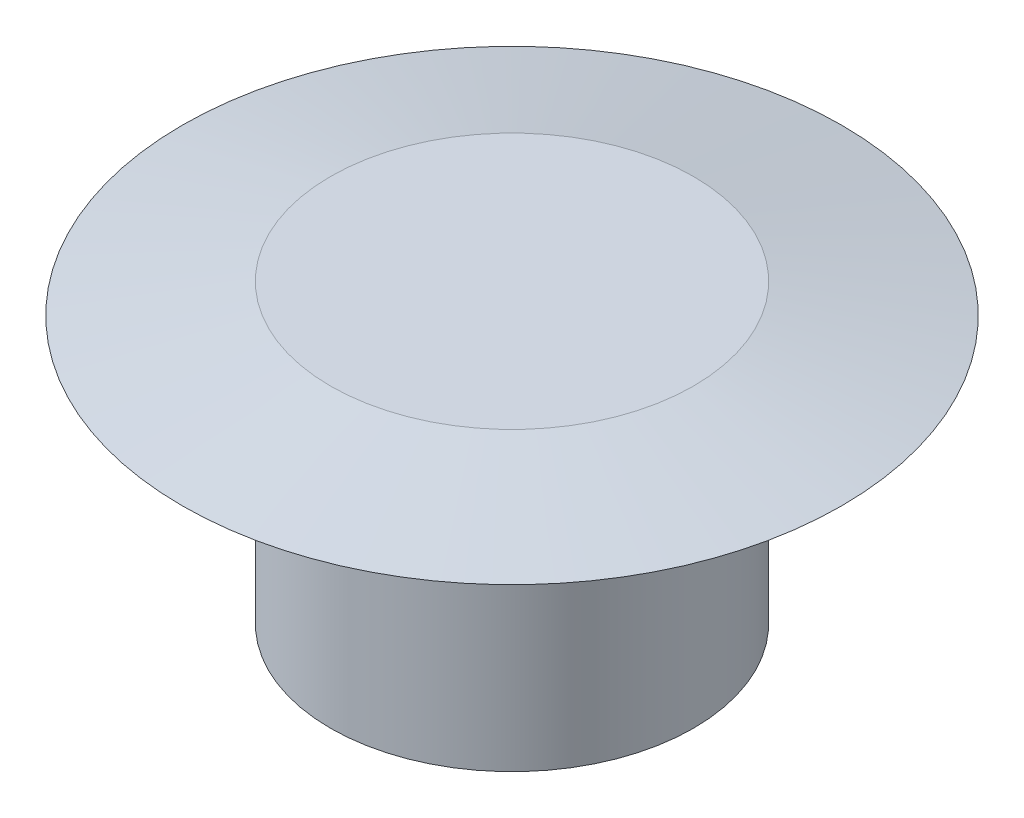
ISO-10303-21;
HEADER;
FILE_DESCRIPTION(('STEP AP214'),'2;1');
FILE_NAME('part.step','',(''),(''),'','','');
FILE_SCHEMA(('AUTOMOTIVE_DESIGN { 1 0 10303 214 1 1 1 1 }'));
ENDSEC;
DATA;
#1=APPLICATION_CONTEXT('core data for automotive mechanical design processes');
#2=APPLICATION_PROTOCOL_DEFINITION('international standard','automotive_design',2000,#1);
#3=PRODUCT_CONTEXT('',#1,'mechanical');
#4=PRODUCT('Part','Part','',(#3));
#5=PRODUCT_RELATED_PRODUCT_CATEGORY('part','',(#4));
#6=PRODUCT_DEFINITION_FORMATION('','',#4);
#7=PRODUCT_DEFINITION_CONTEXT('part definition',#1,'design');
#8=PRODUCT_DEFINITION('design','',#6,#7);
#9=PRODUCT_DEFINITION_SHAPE('','',#8);
#10=(LENGTH_UNIT() NAMED_UNIT(*) SI_UNIT(.MILLI.,.METRE.));
#11=(NAMED_UNIT(*) PLANE_ANGLE_UNIT() SI_UNIT($,.RADIAN.));
#12=(NAMED_UNIT(*) SI_UNIT($,.STERADIAN.) SOLID_ANGLE_UNIT());
#13=UNCERTAINTY_MEASURE_WITH_UNIT(LENGTH_MEASURE(1.E-05),#10,'distance_accuracy_value','');
#14=(GEOMETRIC_REPRESENTATION_CONTEXT(3) GLOBAL_UNCERTAINTY_ASSIGNED_CONTEXT((#13)) GLOBAL_UNIT_ASSIGNED_CONTEXT((#10,
#11,#12)) REPRESENTATION_CONTEXT('',''));
#15=CARTESIAN_POINT('',(0.,0.,0.));
#16=DIRECTION('',(0.,0.,1.));
#17=DIRECTION('',(1.,0.,0.));
#18=AXIS2_PLACEMENT_3D('',#15,#16,#17);
#19=CARTESIAN_POINT('',(0.,0.,0.));
#20=DIRECTION('',(0.,-1.,0.));
#21=DIRECTION('',(0.,0.,-1.));
#22=AXIS2_PLACEMENT_3D('',#19,#20,#21);
#23=CYLINDRICAL_SURFACE('',#22,10.9);
#24=CARTESIAN_POINT('',(0.,0.,0.));
#25=DIRECTION('',(0.,-1.,0.));
#26=DIRECTION('',(0.,0.,-1.));
#27=AXIS2_PLACEMENT_3D('',#24,#25,#26);
#28=CIRCLE('',#27,10.9);
#29=CARTESIAN_POINT('',(0.,0.,-10.9));
#30=VERTEX_POINT('',#29);
#31=EDGE_CURVE('E38',#30,#30,#28,.T.);
#32=ORIENTED_EDGE('',*,*,#31,.T.);
#33=EDGE_LOOP('',(#32));
#34=FACE_BOUND('',#33,.T.);
#35=CARTESIAN_POINT('',(0.,18.65,0.));
#36=DIRECTION('',(0.,1.,0.));
#37=DIRECTION('',(0.,0.,1.));
#38=AXIS2_PLACEMENT_3D('',#35,#36,#37);
#39=CIRCLE('',#38,10.9);
#40=CARTESIAN_POINT('',(0.,18.65,10.9));
#41=VERTEX_POINT('',#40);
#42=EDGE_CURVE('E10',#41,#41,#39,.F.);
#43=ORIENTED_EDGE('',*,*,#42,.F.);
#44=EDGE_LOOP('',(#43));
#45=FACE_BOUND('',#44,.T.);
#46=ADVANCED_FACE('F31',(#34,#45),#23,.F.);
#47=CARTESIAN_POINT('',(-12.25,20.,0.));
#48=DIRECTION('',(0.,-1.,0.));
#49=DIRECTION('',(0.,0.,-1.));
#50=AXIS2_PLACEMENT_3D('',#47,#48,#49);
#51=PLANE('',#50);
#52=CARTESIAN_POINT('',(0.,20.,0.));
#53=DIRECTION('',(0.,-1.,0.));
#54=DIRECTION('',(0.,0.,-1.));
#55=AXIS2_PLACEMENT_3D('',#52,#53,#54);
#56=CIRCLE('',#55,12.25);
#57=CARTESIAN_POINT('',(0.,20.,-12.25));
#58=VERTEX_POINT('',#57);
#59=EDGE_CURVE('E54',#58,#58,#56,.T.);
#60=ORIENTED_EDGE('',*,*,#59,.F.);
#61=EDGE_LOOP('',(#60));
#62=FACE_BOUND('',#61,.T.);
#63=ADVANCED_FACE('F33',(#62),#51,.F.);
#64=CARTESIAN_POINT('',(-10.9,0.,0.));
#65=DIRECTION('',(0.,1.,0.));
#66=DIRECTION('',(0.,0.,1.));
#67=AXIS2_PLACEMENT_3D('',#64,#65,#66);
#68=PLANE('',#67);
#69=ORIENTED_EDGE('',*,*,#31,.F.);
#70=EDGE_LOOP('',(#69));
#71=FACE_BOUND('',#70,.T.);
#72=CARTESIAN_POINT('',(0.,0.,0.));
#73=DIRECTION('',(0.,-1.,0.));
#74=DIRECTION('',(0.,0.,-1.));
#75=AXIS2_PLACEMENT_3D('',#72,#73,#74);
#76=CIRCLE('',#75,12.25);
#77=CARTESIAN_POINT('',(0.,0.,-12.25));
#78=VERTEX_POINT('',#77);
#79=EDGE_CURVE('E42',#78,#78,#76,.T.);
#80=ORIENTED_EDGE('',*,*,#79,.T.);
#81=EDGE_LOOP('',(#80));
#82=FACE_BOUND('',#81,.T.);
#83=ADVANCED_FACE('F61',(#71,#82),#68,.F.);
#84=CARTESIAN_POINT('',(0.,0.,0.));
#85=DIRECTION('',(0.,-1.,0.));
#86=DIRECTION('',(0.,0.,-1.));
#87=AXIS2_PLACEMENT_3D('',#84,#85,#86);
#88=CYLINDRICAL_SURFACE('',#87,12.25);
#89=ORIENTED_EDGE('',*,*,#79,.F.);
#90=EDGE_LOOP('',(#89));
#91=FACE_BOUND('',#90,.T.);
#92=CARTESIAN_POINT('',(0.,18.,0.));
#93=DIRECTION('',(0.,-1.,0.));
#94=DIRECTION('',(0.,0.,-1.));
#95=AXIS2_PLACEMENT_3D('',#92,#93,#94);
#96=CIRCLE('',#95,12.25);
#97=CARTESIAN_POINT('',(0.,18.,-12.25));
#98=VERTEX_POINT('',#97);
#99=EDGE_CURVE('E46',#98,#98,#96,.T.);
#100=ORIENTED_EDGE('',*,*,#99,.T.);
#101=EDGE_LOOP('',(#100));
#102=FACE_BOUND('',#101,.T.);
#103=ADVANCED_FACE('F66',(#91,#102),#88,.T.);
#104=CARTESIAN_POINT('',(-12.25,18.,0.));
#105=DIRECTION('',(0.,1.,0.));
#106=DIRECTION('',(0.,0.,1.));
#107=AXIS2_PLACEMENT_3D('',#104,#105,#106);
#108=PLANE('',#107);
#109=ORIENTED_EDGE('',*,*,#99,.F.);
#110=EDGE_LOOP('',(#109));
#111=FACE_BOUND('',#110,.T.);
#112=CARTESIAN_POINT('',(0.,18.,0.));
#113=DIRECTION('',(0.,-1.,0.));
#114=DIRECTION('',(0.,0.,-1.));
#115=AXIS2_PLACEMENT_3D('',#112,#113,#114);
#116=CIRCLE('',#115,22.25);
#117=CARTESIAN_POINT('',(0.,18.,-22.25));
#118=VERTEX_POINT('',#117);
#119=EDGE_CURVE('E51',#118,#118,#116,.T.);
#120=ORIENTED_EDGE('',*,*,#119,.T.);
#121=EDGE_LOOP('',(#120));
#122=FACE_BOUND('',#121,.T.);
#123=ADVANCED_FACE('F75',(#111,#122),#108,.F.);
#124=CARTESIAN_POINT('',(0.,20.,0.));
#125=DIRECTION('',(0.,-1.,0.));
#126=DIRECTION('',(0.,0.,-1.));
#127=AXIS2_PLACEMENT_3D('',#124,#125,#126);
#128=CONICAL_SURFACE('',#127,12.25,1.37340076694502);
#129=ORIENTED_EDGE('',*,*,#119,.F.);
#130=EDGE_LOOP('',(#129));
#131=FACE_BOUND('',#130,.T.);
#132=ORIENTED_EDGE('',*,*,#59,.T.);
#133=EDGE_LOOP('',(#132));
#134=FACE_BOUND('',#133,.T.);
#135=ADVANCED_FACE('F58',(#131,#134),#128,.T.);
#136=CARTESIAN_POINT('',(0.,18.65,0.));
#137=DIRECTION('',(0.,1.,0.));
#138=DIRECTION('',(0.,0.,1.));
#139=AXIS2_PLACEMENT_3D('',#136,#137,#138);
#140=PLANE('',#139);
#141=ORIENTED_EDGE('',*,*,#42,.T.);
#142=EDGE_LOOP('',(#141));
#143=FACE_BOUND('',#142,.T.);
#144=ADVANCED_FACE('F82',(#143),#140,.F.);
#145=CLOSED_SHELL('',(#46,#63,#83,#103,#123,#135,#144));
#146=MANIFOLD_SOLID_BREP('B2',#145);
#147=ADVANCED_BREP_SHAPE_REPRESENTATION('',(#18,#146),#14);
#148=SHAPE_DEFINITION_REPRESENTATION(#9,#147);
ENDSEC;
END-ISO-10303-21;
